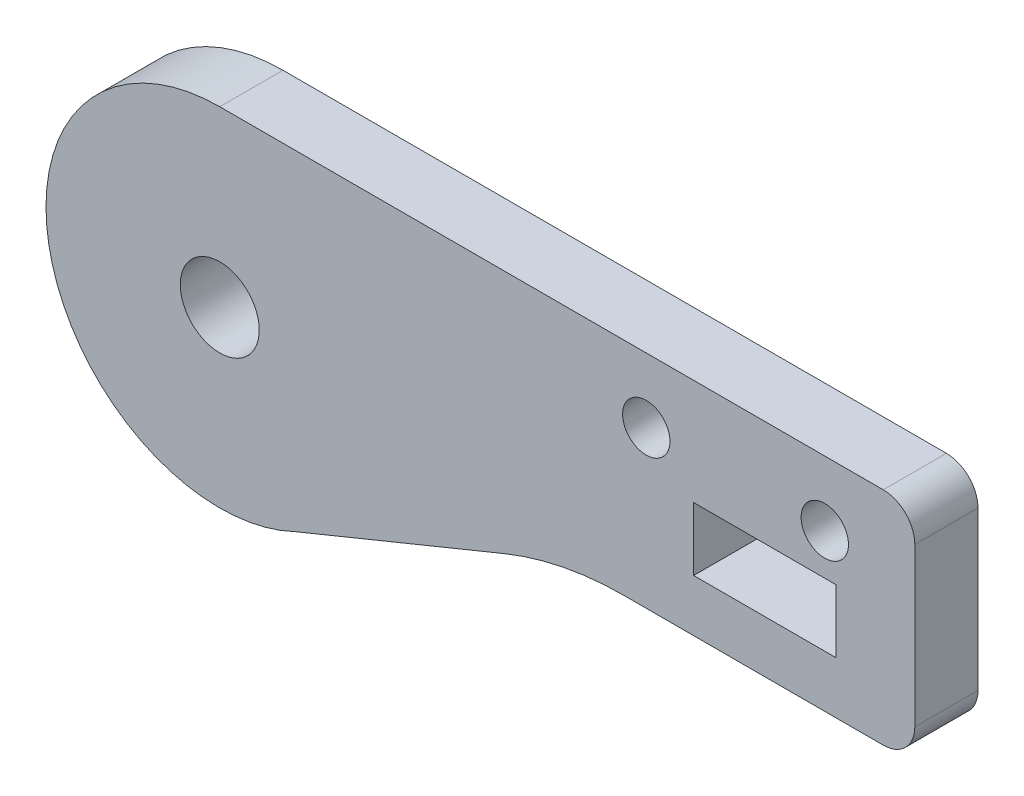
ISO-10303-21;
HEADER;
FILE_DESCRIPTION(('STEP AP214'),'2;1');
FILE_NAME('part.step','',(''),(''),'','','');
FILE_SCHEMA(('AUTOMOTIVE_DESIGN { 1 0 10303 214 1 1 1 1 }'));
ENDSEC;
DATA;
#1=APPLICATION_CONTEXT('core data for automotive mechanical design processes');
#2=APPLICATION_PROTOCOL_DEFINITION('international standard','automotive_design',2000,#1);
#3=PRODUCT_CONTEXT('',#1,'mechanical');
#4=PRODUCT('Part','Part','',(#3));
#5=PRODUCT_RELATED_PRODUCT_CATEGORY('part','',(#4));
#6=PRODUCT_DEFINITION_FORMATION('','',#4);
#7=PRODUCT_DEFINITION_CONTEXT('part definition',#1,'design');
#8=PRODUCT_DEFINITION('design','',#6,#7);
#9=PRODUCT_DEFINITION_SHAPE('','',#8);
#10=(LENGTH_UNIT() NAMED_UNIT(*) SI_UNIT(.MILLI.,.METRE.));
#11=(NAMED_UNIT(*) PLANE_ANGLE_UNIT() SI_UNIT($,.RADIAN.));
#12=(NAMED_UNIT(*) SI_UNIT($,.STERADIAN.) SOLID_ANGLE_UNIT());
#13=UNCERTAINTY_MEASURE_WITH_UNIT(LENGTH_MEASURE(1.E-05),#10,'distance_accuracy_value','');
#14=(GEOMETRIC_REPRESENTATION_CONTEXT(3) GLOBAL_UNCERTAINTY_ASSIGNED_CONTEXT((#13)) GLOBAL_UNIT_ASSIGNED_CONTEXT((#10,
#11,#12)) REPRESENTATION_CONTEXT('',''));
#15=CARTESIAN_POINT('',(0.,0.,0.));
#16=DIRECTION('',(0.,0.,1.));
#17=DIRECTION('',(1.,0.,0.));
#18=AXIS2_PLACEMENT_3D('',#15,#16,#17);
#19=CARTESIAN_POINT('',(53.,39.0985848333902,4.));
#20=DIRECTION('',(0.,0.,1.));
#21=DIRECTION('',(1.,0.,0.));
#22=AXIS2_PLACEMENT_3D('',#19,#20,#21);
#23=PLANE('',#22);
#24=CARTESIAN_POINT('',(49.3,36.9985848333902,4.));
#25=DIRECTION('',(0.,0.,1.));
#26=DIRECTION('',(1.,0.,0.));
#27=AXIS2_PLACEMENT_3D('',#24,#25,#26);
#28=CIRCLE('',#27,1.5);
#29=CARTESIAN_POINT('',(50.8,36.9985848333902,4.));
#30=VERTEX_POINT('',#29);
#31=EDGE_CURVE('E314',#30,#30,#28,.T.);
#32=ORIENTED_EDGE('',*,*,#31,.F.);
#33=EDGE_LOOP('',(#32));
#34=FACE_BOUND('',#33,.T.);
#35=DIRECTION('',(-1.,0.,0.));
#36=VECTOR('',#35,1.);
#37=CARTESIAN_POINT('',(41.,34.3985848333902,4.));
#38=LINE('',#37,#36);
#39=CARTESIAN_POINT('',(50.,34.3985848333902,4.));
#40=VERTEX_POINT('',#39);
#41=CARTESIAN_POINT('',(41.,34.3985848333902,4.));
#42=VERTEX_POINT('',#41);
#43=EDGE_CURVE('E129',#40,#42,#38,.T.);
#44=ORIENTED_EDGE('',*,*,#43,.F.);
#45=DIRECTION('',(0.,1.,0.));
#46=VECTOR('',#45,1.);
#47=CARTESIAN_POINT('',(50.,30.3985848333902,4.));
#48=LINE('',#47,#46);
#49=CARTESIAN_POINT('',(50.,30.3985848333902,4.));
#50=VERTEX_POINT('',#49);
#51=EDGE_CURVE('E121',#50,#40,#48,.T.);
#52=ORIENTED_EDGE('',*,*,#51,.F.);
#53=DIRECTION('',(1.,0.,0.));
#54=VECTOR('',#53,1.);
#55=CARTESIAN_POINT('',(50.,30.3985848333902,4.));
#56=LINE('',#55,#54);
#57=CARTESIAN_POINT('',(41.,30.3985848333902,4.));
#58=VERTEX_POINT('',#57);
#59=EDGE_CURVE('E144',#58,#50,#56,.T.);
#60=ORIENTED_EDGE('',*,*,#59,.F.);
#61=DIRECTION('',(0.,-1.,0.));
#62=VECTOR('',#61,1.);
#63=CARTESIAN_POINT('',(41.,30.3985848333902,4.));
#64=LINE('',#63,#62);
#65=EDGE_CURVE('E142',#42,#58,#64,.T.);
#66=ORIENTED_EDGE('',*,*,#65,.F.);
#67=EDGE_LOOP('',(#44,#52,#60,#66));
#68=FACE_BOUND('',#67,.T.);
#69=CARTESIAN_POINT('',(53.,39.0985848333902,4.));
#70=DIRECTION('',(0.,0.,1.));
#71=DIRECTION('',(1.,0.,0.));
#72=AXIS2_PLACEMENT_3D('',#69,#70,#71);
#73=CIRCLE('',#72,1.99999999999999);
#74=CARTESIAN_POINT('',(55.,39.0985848333902,4.));
#75=VERTEX_POINT('',#74);
#76=CARTESIAN_POINT('',(53.,41.0985848333901,4.));
#77=VERTEX_POINT('',#76);
#78=EDGE_CURVE('E160',#75,#77,#73,.T.);
#79=ORIENTED_EDGE('',*,*,#78,.T.);
#80=DIRECTION('',(-1.,0.,0.));
#81=VECTOR('',#80,1.);
#82=CARTESIAN_POINT('',(53.,41.0985848333901,4.));
#83=LINE('',#82,#81);
#84=CARTESIAN_POINT('',(11.,41.0985848333902,4.));
#85=VERTEX_POINT('',#84);
#86=EDGE_CURVE('E163',#77,#85,#83,.T.);
#87=ORIENTED_EDGE('',*,*,#86,.T.);
#88=CARTESIAN_POINT('',(11.,30.0985848333902,4.));
#89=DIRECTION('',(0.,0.,1.));
#90=DIRECTION('',(1.,0.,0.));
#91=AXIS2_PLACEMENT_3D('',#88,#89,#90);
#92=CIRCLE('',#91,11.);
#93=CARTESIAN_POINT('',(15.7721782585681,20.1876658715355,4.));
#94=VERTEX_POINT('',#93);
#95=EDGE_CURVE('E166',#85,#94,#92,.T.);
#96=ORIENTED_EDGE('',*,*,#95,.T.);
#97=DIRECTION('',(0.925553149998414,0.378617704984875,0.));
#98=VECTOR('',#97,1.);
#99=CARTESIAN_POINT('',(29.0265306513074,25.6096478333584,4.));
#100=LINE('',#99,#98);
#101=CARTESIAN_POINT('',(29.0265306513074,25.6096478333584,4.));
#102=VERTEX_POINT('',#101);
#103=EDGE_CURVE('E168',#94,#102,#100,.T.);
#104=ORIENTED_EDGE('',*,*,#103,.T.);
#105=CARTESIAN_POINT('',(36.598884751005,7.09858483339016,4.));
#106=DIRECTION('',(0.,0.,-1.));
#107=DIRECTION('',(1.,0.,0.));
#108=AXIS2_PLACEMENT_3D('',#105,#106,#107);
#109=CIRCLE('',#108,20.);
#110=CARTESIAN_POINT('',(36.598884751005,27.0985848333902,4.));
#111=VERTEX_POINT('',#110);
#112=EDGE_CURVE('E170',#102,#111,#109,.T.);
#113=ORIENTED_EDGE('',*,*,#112,.T.);
#114=DIRECTION('',(1.,0.,0.));
#115=VECTOR('',#114,1.);
#116=CARTESIAN_POINT('',(53.,27.0985848333902,4.));
#117=LINE('',#116,#115);
#118=CARTESIAN_POINT('',(53.,27.0985848333902,4.));
#119=VERTEX_POINT('',#118);
#120=EDGE_CURVE('E172',#111,#119,#117,.T.);
#121=ORIENTED_EDGE('',*,*,#120,.T.);
#122=CARTESIAN_POINT('',(53.,29.0985848333902,4.));
#123=DIRECTION('',(0.,0.,1.));
#124=DIRECTION('',(1.,0.,0.));
#125=AXIS2_PLACEMENT_3D('',#122,#123,#124);
#126=CIRCLE('',#125,2.);
#127=CARTESIAN_POINT('',(55.,29.0985848333902,4.));
#128=VERTEX_POINT('',#127);
#129=EDGE_CURVE('E174',#119,#128,#126,.T.);
#130=ORIENTED_EDGE('',*,*,#129,.T.);
#131=DIRECTION('',(0.,1.,0.));
#132=VECTOR('',#131,1.);
#133=CARTESIAN_POINT('',(55.,39.0985848333902,4.));
#134=LINE('',#133,#132);
#135=EDGE_CURVE('E176',#128,#75,#134,.T.);
#136=ORIENTED_EDGE('',*,*,#135,.T.);
#137=EDGE_LOOP('',(#79,#87,#96,#104,#113,#121,#130,#136));
#138=FACE_BOUND('',#137,.T.);
#139=CARTESIAN_POINT('',(38.,36.9985848333902,4.));
#140=DIRECTION('',(0.,0.,1.));
#141=DIRECTION('',(1.,0.,0.));
#142=AXIS2_PLACEMENT_3D('',#139,#140,#141);
#143=CIRCLE('',#142,1.5);
#144=CARTESIAN_POINT('',(39.5,36.9985848333902,4.));
#145=VERTEX_POINT('',#144);
#146=EDGE_CURVE('E150',#145,#145,#143,.T.);
#147=ORIENTED_EDGE('',*,*,#146,.F.);
#148=EDGE_LOOP('',(#147));
#149=FACE_BOUND('',#148,.T.);
#150=CARTESIAN_POINT('',(11.,30.0985848333902,4.));
#151=DIRECTION('',(0.,0.,1.));
#152=DIRECTION('',(1.,0.,0.));
#153=AXIS2_PLACEMENT_3D('',#150,#151,#152);
#154=CIRCLE('',#153,2.5);
#155=CARTESIAN_POINT('',(13.5,30.0985848333902,4.));
#156=VERTEX_POINT('',#155);
#157=EDGE_CURVE('E305',#156,#156,#154,.T.);
#158=ORIENTED_EDGE('',*,*,#157,.F.);
#159=EDGE_LOOP('',(#158));
#160=FACE_BOUND('',#159,.T.);
#161=ADVANCED_FACE('F32',(#34,#68,#138,#149,#160),#23,.T.);
#162=CARTESIAN_POINT('',(53.,39.0985848333902,0.));
#163=DIRECTION('',(0.,0.,1.));
#164=DIRECTION('',(1.,0.,0.));
#165=AXIS2_PLACEMENT_3D('',#162,#163,#164);
#166=PLANE('',#165);
#167=CARTESIAN_POINT('',(49.3,36.9985848333902,0.));
#168=DIRECTION('',(0.,0.,1.));
#169=DIRECTION('',(1.,0.,0.));
#170=AXIS2_PLACEMENT_3D('',#167,#168,#169);
#171=CIRCLE('',#170,1.5);
#172=CARTESIAN_POINT('',(50.8,36.9985848333902,0.));
#173=VERTEX_POINT('',#172);
#174=EDGE_CURVE('E311',#173,#173,#171,.T.);
#175=ORIENTED_EDGE('',*,*,#174,.T.);
#176=EDGE_LOOP('',(#175));
#177=FACE_BOUND('',#176,.T.);
#178=DIRECTION('',(0.,1.,0.));
#179=VECTOR('',#178,1.);
#180=CARTESIAN_POINT('',(50.,30.3985848333902,0.));
#181=LINE('',#180,#179);
#182=CARTESIAN_POINT('',(50.,30.3985848333902,0.));
#183=VERTEX_POINT('',#182);
#184=CARTESIAN_POINT('',(50.,34.3985848333902,0.));
#185=VERTEX_POINT('',#184);
#186=EDGE_CURVE('E55',#183,#185,#181,.T.);
#187=ORIENTED_EDGE('',*,*,#186,.T.);
#188=DIRECTION('',(-1.,0.,0.));
#189=VECTOR('',#188,1.);
#190=CARTESIAN_POINT('',(41.,34.3985848333902,0.));
#191=LINE('',#190,#189);
#192=CARTESIAN_POINT('',(41.,34.3985848333902,0.));
#193=VERTEX_POINT('',#192);
#194=EDGE_CURVE('E136',#185,#193,#191,.T.);
#195=ORIENTED_EDGE('',*,*,#194,.T.);
#196=DIRECTION('',(0.,-1.,0.));
#197=VECTOR('',#196,1.);
#198=CARTESIAN_POINT('',(41.,30.3985848333902,0.));
#199=LINE('',#198,#197);
#200=CARTESIAN_POINT('',(41.,30.3985848333902,0.));
#201=VERTEX_POINT('',#200);
#202=EDGE_CURVE('E152',#193,#201,#199,.T.);
#203=ORIENTED_EDGE('',*,*,#202,.T.);
#204=DIRECTION('',(1.,0.,0.));
#205=VECTOR('',#204,1.);
#206=CARTESIAN_POINT('',(50.,30.3985848333902,0.));
#207=LINE('',#206,#205);
#208=EDGE_CURVE('E130',#201,#183,#207,.T.);
#209=ORIENTED_EDGE('',*,*,#208,.T.);
#210=EDGE_LOOP('',(#187,#195,#203,#209));
#211=FACE_BOUND('',#210,.T.);
#212=CARTESIAN_POINT('',(53.,39.0985848333902,0.));
#213=DIRECTION('',(0.,0.,1.));
#214=DIRECTION('',(1.,0.,0.));
#215=AXIS2_PLACEMENT_3D('',#212,#213,#214);
#216=CIRCLE('',#215,1.99999999999999);
#217=CARTESIAN_POINT('',(55.,39.0985848333902,0.));
#218=VERTEX_POINT('',#217);
#219=CARTESIAN_POINT('',(53.,41.0985848333901,0.));
#220=VERTEX_POINT('',#219);
#221=EDGE_CURVE('E137',#218,#220,#216,.T.);
#222=ORIENTED_EDGE('',*,*,#221,.F.);
#223=DIRECTION('',(0.,1.,0.));
#224=VECTOR('',#223,1.);
#225=CARTESIAN_POINT('',(55.,39.0985848333902,0.));
#226=LINE('',#225,#224);
#227=CARTESIAN_POINT('',(55.,29.0985848333902,0.));
#228=VERTEX_POINT('',#227);
#229=EDGE_CURVE('E164',#228,#218,#226,.T.);
#230=ORIENTED_EDGE('',*,*,#229,.F.);
#231=CARTESIAN_POINT('',(53.,29.0985848333902,0.));
#232=DIRECTION('',(0.,0.,1.));
#233=DIRECTION('',(1.,0.,0.));
#234=AXIS2_PLACEMENT_3D('',#231,#232,#233);
#235=CIRCLE('',#234,2.);
#236=CARTESIAN_POINT('',(53.,27.0985848333902,0.));
#237=VERTEX_POINT('',#236);
#238=EDGE_CURVE('E191',#237,#228,#235,.T.);
#239=ORIENTED_EDGE('',*,*,#238,.F.);
#240=DIRECTION('',(1.,0.,0.));
#241=VECTOR('',#240,1.);
#242=CARTESIAN_POINT('',(53.,27.0985848333902,0.));
#243=LINE('',#242,#241);
#244=CARTESIAN_POINT('',(36.598884751005,27.0985848333902,0.));
#245=VERTEX_POINT('',#244);
#246=EDGE_CURVE('E189',#245,#237,#243,.T.);
#247=ORIENTED_EDGE('',*,*,#246,.F.);
#248=CARTESIAN_POINT('',(36.598884751005,7.09858483339016,0.));
#249=DIRECTION('',(0.,0.,-1.));
#250=DIRECTION('',(1.,0.,0.));
#251=AXIS2_PLACEMENT_3D('',#248,#249,#250);
#252=CIRCLE('',#251,20.);
#253=CARTESIAN_POINT('',(29.0265306513074,25.6096478333584,0.));
#254=VERTEX_POINT('',#253);
#255=EDGE_CURVE('E187',#254,#245,#252,.T.);
#256=ORIENTED_EDGE('',*,*,#255,.F.);
#257=DIRECTION('',(0.925553149998414,0.378617704984875,0.));
#258=VECTOR('',#257,1.);
#259=CARTESIAN_POINT('',(29.0265306513074,25.6096478333584,0.));
#260=LINE('',#259,#258);
#261=CARTESIAN_POINT('',(15.7721782585681,20.1876658715355,0.));
#262=VERTEX_POINT('',#261);
#263=EDGE_CURVE('E185',#262,#254,#260,.T.);
#264=ORIENTED_EDGE('',*,*,#263,.F.);
#265=CARTESIAN_POINT('',(11.,30.0985848333902,0.));
#266=DIRECTION('',(0.,0.,1.));
#267=DIRECTION('',(1.,0.,0.));
#268=AXIS2_PLACEMENT_3D('',#265,#266,#267);
#269=CIRCLE('',#268,11.);
#270=CARTESIAN_POINT('',(11.,41.0985848333902,0.));
#271=VERTEX_POINT('',#270);
#272=EDGE_CURVE('E183',#271,#262,#269,.T.);
#273=ORIENTED_EDGE('',*,*,#272,.F.);
#274=DIRECTION('',(-1.,0.,0.));
#275=VECTOR('',#274,1.);
#276=CARTESIAN_POINT('',(53.,41.0985848333901,0.));
#277=LINE('',#276,#275);
#278=EDGE_CURVE('E181',#220,#271,#277,.T.);
#279=ORIENTED_EDGE('',*,*,#278,.F.);
#280=EDGE_LOOP('',(#222,#230,#239,#247,#256,#264,#273,#279));
#281=FACE_BOUND('',#280,.T.);
#282=CARTESIAN_POINT('',(38.,36.9985848333902,0.));
#283=DIRECTION('',(0.,0.,1.));
#284=DIRECTION('',(1.,0.,0.));
#285=AXIS2_PLACEMENT_3D('',#282,#283,#284);
#286=CIRCLE('',#285,1.5);
#287=CARTESIAN_POINT('',(39.5,36.9985848333902,0.));
#288=VERTEX_POINT('',#287);
#289=EDGE_CURVE('E317',#288,#288,#286,.T.);
#290=ORIENTED_EDGE('',*,*,#289,.T.);
#291=EDGE_LOOP('',(#290));
#292=FACE_BOUND('',#291,.T.);
#293=CARTESIAN_POINT('',(11.,30.0985848333902,0.));
#294=DIRECTION('',(0.,0.,1.));
#295=DIRECTION('',(1.,0.,0.));
#296=AXIS2_PLACEMENT_3D('',#293,#294,#295);
#297=CIRCLE('',#296,2.5);
#298=CARTESIAN_POINT('',(13.5,30.0985848333902,0.));
#299=VERTEX_POINT('',#298);
#300=EDGE_CURVE('E308',#299,#299,#297,.T.);
#301=ORIENTED_EDGE('',*,*,#300,.T.);
#302=EDGE_LOOP('',(#301));
#303=FACE_BOUND('',#302,.T.);
#304=ADVANCED_FACE('F221',(#177,#211,#281,#292,#303),#166,.F.);
#305=CARTESIAN_POINT('',(53.,39.0985848333902,4.));
#306=DIRECTION('',(0.,0.,-1.));
#307=DIRECTION('',(-1.,0.,0.));
#308=AXIS2_PLACEMENT_3D('',#305,#306,#307);
#309=CYLINDRICAL_SURFACE('',#308,1.99999999999999);
#310=ORIENTED_EDGE('',*,*,#221,.T.);
#311=DIRECTION('',(0.,0.,-1.));
#312=VECTOR('',#311,1.);
#313=CARTESIAN_POINT('',(53.,41.0985848333901,4.));
#314=LINE('',#313,#312);
#315=EDGE_CURVE('E11',#77,#220,#314,.T.);
#316=ORIENTED_EDGE('',*,*,#315,.F.);
#317=ORIENTED_EDGE('',*,*,#78,.F.);
#318=DIRECTION('',(0.,0.,-1.));
#319=VECTOR('',#318,1.);
#320=CARTESIAN_POINT('',(55.,39.0985848333902,4.));
#321=LINE('',#320,#319);
#322=EDGE_CURVE('E178',#75,#218,#321,.T.);
#323=ORIENTED_EDGE('',*,*,#322,.T.);
#324=EDGE_LOOP('',(#310,#316,#317,#323));
#325=FACE_BOUND('',#324,.T.);
#326=ADVANCED_FACE('F34',(#325),#309,.T.);
#327=CARTESIAN_POINT('',(53.,41.0985848333901,4.));
#328=DIRECTION('',(0.,-1.,0.));
#329=DIRECTION('',(1.,0.,0.));
#330=AXIS2_PLACEMENT_3D('',#327,#328,#329);
#331=PLANE('',#330);
#332=ORIENTED_EDGE('',*,*,#278,.T.);
#333=DIRECTION('',(0.,0.,-1.));
#334=VECTOR('',#333,1.);
#335=CARTESIAN_POINT('',(11.,41.0985848333902,4.));
#336=LINE('',#335,#334);
#337=EDGE_CURVE('E40',#85,#271,#336,.T.);
#338=ORIENTED_EDGE('',*,*,#337,.F.);
#339=ORIENTED_EDGE('',*,*,#86,.F.);
#340=ORIENTED_EDGE('',*,*,#315,.T.);
#341=EDGE_LOOP('',(#332,#338,#339,#340));
#342=FACE_BOUND('',#341,.T.);
#343=ADVANCED_FACE('F238',(#342),#331,.F.);
#344=CARTESIAN_POINT('',(11.,30.0985848333902,4.));
#345=DIRECTION('',(0.,0.,-1.));
#346=DIRECTION('',(-1.,0.,0.));
#347=AXIS2_PLACEMENT_3D('',#344,#345,#346);
#348=CYLINDRICAL_SURFACE('',#347,11.);
#349=ORIENTED_EDGE('',*,*,#272,.T.);
#350=DIRECTION('',(0.,0.,-1.));
#351=VECTOR('',#350,1.);
#352=CARTESIAN_POINT('',(15.7721782585681,20.1876658715355,4.));
#353=LINE('',#352,#351);
#354=EDGE_CURVE('E208',#94,#262,#353,.T.);
#355=ORIENTED_EDGE('',*,*,#354,.F.);
#356=ORIENTED_EDGE('',*,*,#95,.F.);
#357=ORIENTED_EDGE('',*,*,#337,.T.);
#358=EDGE_LOOP('',(#349,#355,#356,#357));
#359=FACE_BOUND('',#358,.T.);
#360=ADVANCED_FACE('F215',(#359),#348,.T.);
#361=CARTESIAN_POINT('',(29.0265306513074,25.6096478333584,4.));
#362=DIRECTION('',(-0.378617704984875,0.925553149998414,0.));
#363=DIRECTION('',(-0.925553149998414,-0.378617704984875,0.));
#364=AXIS2_PLACEMENT_3D('',#361,#362,#363);
#365=PLANE('',#364);
#366=ORIENTED_EDGE('',*,*,#263,.T.);
#367=DIRECTION('',(0.,0.,-1.));
#368=VECTOR('',#367,1.);
#369=CARTESIAN_POINT('',(29.0265306513074,25.6096478333584,4.));
#370=LINE('',#369,#368);
#371=EDGE_CURVE('E205',#102,#254,#370,.T.);
#372=ORIENTED_EDGE('',*,*,#371,.F.);
#373=ORIENTED_EDGE('',*,*,#103,.F.);
#374=ORIENTED_EDGE('',*,*,#354,.T.);
#375=EDGE_LOOP('',(#366,#372,#373,#374));
#376=FACE_BOUND('',#375,.T.);
#377=ADVANCED_FACE('F227',(#376),#365,.F.);
#378=CARTESIAN_POINT('',(36.598884751005,7.09858483339016,4.));
#379=DIRECTION('',(0.,0.,-1.));
#380=DIRECTION('',(-1.,0.,0.));
#381=AXIS2_PLACEMENT_3D('',#378,#379,#380);
#382=CYLINDRICAL_SURFACE('',#381,20.);
#383=ORIENTED_EDGE('',*,*,#255,.T.);
#384=DIRECTION('',(0.,0.,-1.));
#385=VECTOR('',#384,1.);
#386=CARTESIAN_POINT('',(36.598884751005,27.0985848333902,4.));
#387=LINE('',#386,#385);
#388=EDGE_CURVE('E202',#111,#245,#387,.T.);
#389=ORIENTED_EDGE('',*,*,#388,.F.);
#390=ORIENTED_EDGE('',*,*,#112,.F.);
#391=ORIENTED_EDGE('',*,*,#371,.T.);
#392=EDGE_LOOP('',(#383,#389,#390,#391));
#393=FACE_BOUND('',#392,.T.);
#394=ADVANCED_FACE('F231',(#393),#382,.F.);
#395=CARTESIAN_POINT('',(53.,27.0985848333902,4.));
#396=DIRECTION('',(0.,1.,0.));
#397=DIRECTION('',(0.,0.,1.));
#398=AXIS2_PLACEMENT_3D('',#395,#396,#397);
#399=PLANE('',#398);
#400=ORIENTED_EDGE('',*,*,#246,.T.);
#401=DIRECTION('',(0.,0.,-1.));
#402=VECTOR('',#401,1.);
#403=CARTESIAN_POINT('',(53.,27.0985848333902,4.));
#404=LINE('',#403,#402);
#405=EDGE_CURVE('E199',#119,#237,#404,.T.);
#406=ORIENTED_EDGE('',*,*,#405,.F.);
#407=ORIENTED_EDGE('',*,*,#120,.F.);
#408=ORIENTED_EDGE('',*,*,#388,.T.);
#409=EDGE_LOOP('',(#400,#406,#407,#408));
#410=FACE_BOUND('',#409,.T.);
#411=ADVANCED_FACE('F251',(#410),#399,.F.);
#412=CARTESIAN_POINT('',(53.,29.0985848333902,4.));
#413=DIRECTION('',(0.,0.,-1.));
#414=DIRECTION('',(-1.,0.,0.));
#415=AXIS2_PLACEMENT_3D('',#412,#413,#414);
#416=CYLINDRICAL_SURFACE('',#415,2.);
#417=ORIENTED_EDGE('',*,*,#238,.T.);
#418=DIRECTION('',(0.,0.,-1.));
#419=VECTOR('',#418,1.);
#420=CARTESIAN_POINT('',(55.,29.0985848333902,4.));
#421=LINE('',#420,#419);
#422=EDGE_CURVE('E196',#128,#228,#421,.T.);
#423=ORIENTED_EDGE('',*,*,#422,.F.);
#424=ORIENTED_EDGE('',*,*,#129,.F.);
#425=ORIENTED_EDGE('',*,*,#405,.T.);
#426=EDGE_LOOP('',(#417,#423,#424,#425));
#427=FACE_BOUND('',#426,.T.);
#428=ADVANCED_FACE('F249',(#427),#416,.T.);
#429=CARTESIAN_POINT('',(55.,39.0985848333902,4.));
#430=DIRECTION('',(-1.,0.,0.));
#431=DIRECTION('',(0.,0.,1.));
#432=AXIS2_PLACEMENT_3D('',#429,#430,#431);
#433=PLANE('',#432);
#434=ORIENTED_EDGE('',*,*,#229,.T.);
#435=ORIENTED_EDGE('',*,*,#322,.F.);
#436=ORIENTED_EDGE('',*,*,#135,.F.);
#437=ORIENTED_EDGE('',*,*,#422,.T.);
#438=EDGE_LOOP('',(#434,#435,#436,#437));
#439=FACE_BOUND('',#438,.T.);
#440=ADVANCED_FACE('F244',(#439),#433,.F.);
#441=CARTESIAN_POINT('',(50.,30.3985848333902,4.));
#442=DIRECTION('',(-1.,0.,0.));
#443=DIRECTION('',(0.,0.,1.));
#444=AXIS2_PLACEMENT_3D('',#441,#442,#443);
#445=PLANE('',#444);
#446=ORIENTED_EDGE('',*,*,#186,.F.);
#447=DIRECTION('',(0.,0.,-1.));
#448=VECTOR('',#447,1.);
#449=CARTESIAN_POINT('',(50.,30.3985848333902,4.));
#450=LINE('',#449,#448);
#451=EDGE_CURVE('E125',#50,#183,#450,.T.);
#452=ORIENTED_EDGE('',*,*,#451,.F.);
#453=ORIENTED_EDGE('',*,*,#51,.T.);
#454=DIRECTION('',(0.,0.,-1.));
#455=VECTOR('',#454,1.);
#456=CARTESIAN_POINT('',(50.,34.3985848333902,4.));
#457=LINE('',#456,#455);
#458=EDGE_CURVE('E124',#40,#185,#457,.T.);
#459=ORIENTED_EDGE('',*,*,#458,.T.);
#460=EDGE_LOOP('',(#446,#452,#453,#459));
#461=FACE_BOUND('',#460,.T.);
#462=ADVANCED_FACE('F123',(#461),#445,.T.);
#463=CARTESIAN_POINT('',(41.,34.3985848333902,4.));
#464=DIRECTION('',(0.,-1.,0.));
#465=DIRECTION('',(0.,0.,-1.));
#466=AXIS2_PLACEMENT_3D('',#463,#464,#465);
#467=PLANE('',#466);
#468=ORIENTED_EDGE('',*,*,#194,.F.);
#469=ORIENTED_EDGE('',*,*,#458,.F.);
#470=ORIENTED_EDGE('',*,*,#43,.T.);
#471=DIRECTION('',(0.,0.,-1.));
#472=VECTOR('',#471,1.);
#473=CARTESIAN_POINT('',(41.,34.3985848333902,4.));
#474=LINE('',#473,#472);
#475=EDGE_CURVE('E138',#42,#193,#474,.T.);
#476=ORIENTED_EDGE('',*,*,#475,.T.);
#477=EDGE_LOOP('',(#468,#469,#470,#476));
#478=FACE_BOUND('',#477,.T.);
#479=ADVANCED_FACE('F133',(#478),#467,.T.);
#480=CARTESIAN_POINT('',(41.,30.3985848333902,4.));
#481=DIRECTION('',(1.,0.,0.));
#482=DIRECTION('',(0.,0.,-1.));
#483=AXIS2_PLACEMENT_3D('',#480,#481,#482);
#484=PLANE('',#483);
#485=ORIENTED_EDGE('',*,*,#202,.F.);
#486=ORIENTED_EDGE('',*,*,#475,.F.);
#487=ORIENTED_EDGE('',*,*,#65,.T.);
#488=DIRECTION('',(0.,0.,-1.));
#489=VECTOR('',#488,1.);
#490=CARTESIAN_POINT('',(41.,30.3985848333902,4.));
#491=LINE('',#490,#489);
#492=EDGE_CURVE('E47',#58,#201,#491,.T.);
#493=ORIENTED_EDGE('',*,*,#492,.T.);
#494=EDGE_LOOP('',(#485,#486,#487,#493));
#495=FACE_BOUND('',#494,.T.);
#496=ADVANCED_FACE('F279',(#495),#484,.T.);
#497=CARTESIAN_POINT('',(50.,30.3985848333902,4.));
#498=DIRECTION('',(0.,1.,0.));
#499=DIRECTION('',(0.,0.,1.));
#500=AXIS2_PLACEMENT_3D('',#497,#498,#499);
#501=PLANE('',#500);
#502=ORIENTED_EDGE('',*,*,#208,.F.);
#503=ORIENTED_EDGE('',*,*,#492,.F.);
#504=ORIENTED_EDGE('',*,*,#59,.T.);
#505=ORIENTED_EDGE('',*,*,#451,.T.);
#506=EDGE_LOOP('',(#502,#503,#504,#505));
#507=FACE_BOUND('',#506,.T.);
#508=ADVANCED_FACE('F283',(#507),#501,.T.);
#509=CARTESIAN_POINT('',(38.,36.9985848333902,4.));
#510=DIRECTION('',(0.,0.,-1.));
#511=DIRECTION('',(-1.,0.,0.));
#512=AXIS2_PLACEMENT_3D('',#509,#510,#511);
#513=CYLINDRICAL_SURFACE('',#512,1.5);
#514=ORIENTED_EDGE('',*,*,#146,.T.);
#515=EDGE_LOOP('',(#514));
#516=FACE_BOUND('',#515,.T.);
#517=ORIENTED_EDGE('',*,*,#289,.F.);
#518=EDGE_LOOP('',(#517));
#519=FACE_BOUND('',#518,.T.);
#520=ADVANCED_FACE('F289',(#516,#519),#513,.F.);
#521=CARTESIAN_POINT('',(49.3,36.9985848333902,4.));
#522=DIRECTION('',(0.,0.,-1.));
#523=DIRECTION('',(-1.,0.,0.));
#524=AXIS2_PLACEMENT_3D('',#521,#522,#523);
#525=CYLINDRICAL_SURFACE('',#524,1.5);
#526=ORIENTED_EDGE('',*,*,#31,.T.);
#527=EDGE_LOOP('',(#526));
#528=FACE_BOUND('',#527,.T.);
#529=ORIENTED_EDGE('',*,*,#174,.F.);
#530=EDGE_LOOP('',(#529));
#531=FACE_BOUND('',#530,.T.);
#532=ADVANCED_FACE('F292',(#528,#531),#525,.F.);
#533=CARTESIAN_POINT('',(11.,30.0985848333902,4.));
#534=DIRECTION('',(0.,0.,-1.));
#535=DIRECTION('',(-1.,0.,0.));
#536=AXIS2_PLACEMENT_3D('',#533,#534,#535);
#537=CYLINDRICAL_SURFACE('',#536,2.5);
#538=ORIENTED_EDGE('',*,*,#157,.T.);
#539=EDGE_LOOP('',(#538));
#540=FACE_BOUND('',#539,.T.);
#541=ORIENTED_EDGE('',*,*,#300,.F.);
#542=EDGE_LOOP('',(#541));
#543=FACE_BOUND('',#542,.T.);
#544=ADVANCED_FACE('F296',(#540,#543),#537,.F.);
#545=CLOSED_SHELL('',(#161,#304,#326,#343,#360,#377,#394,#411,#428,#440,#462,#479,#496,#508,
#520,#532,#544));
#546=MANIFOLD_SOLID_BREP('B2',#545);
#547=ADVANCED_BREP_SHAPE_REPRESENTATION('',(#18,#546),#14);
#548=SHAPE_DEFINITION_REPRESENTATION(#9,#547);
ENDSEC;
END-ISO-10303-21;
